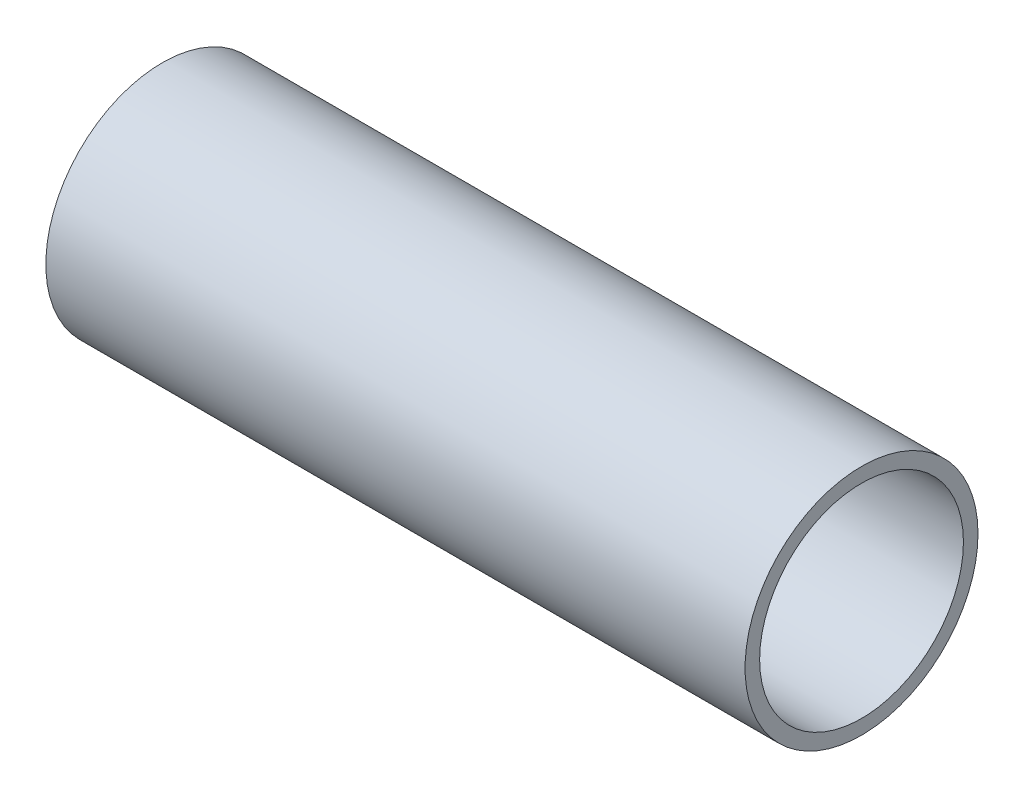
ISO-10303-21;
HEADER;
FILE_DESCRIPTION(('STEP AP214'),'2;1');
FILE_NAME('part.step','',(''),(''),'','','');
FILE_SCHEMA(('AUTOMOTIVE_DESIGN { 1 0 10303 214 1 1 1 1 }'));
ENDSEC;
DATA;
#1=APPLICATION_CONTEXT('core data for automotive mechanical design processes');
#2=APPLICATION_PROTOCOL_DEFINITION('international standard','automotive_design',2000,#1);
#3=PRODUCT_CONTEXT('',#1,'mechanical');
#4=PRODUCT('Part','Part','',(#3));
#5=PRODUCT_RELATED_PRODUCT_CATEGORY('part','',(#4));
#6=PRODUCT_DEFINITION_FORMATION('','',#4);
#7=PRODUCT_DEFINITION_CONTEXT('part definition',#1,'design');
#8=PRODUCT_DEFINITION('design','',#6,#7);
#9=PRODUCT_DEFINITION_SHAPE('','',#8);
#10=(LENGTH_UNIT() NAMED_UNIT(*) SI_UNIT(.MILLI.,.METRE.));
#11=(NAMED_UNIT(*) PLANE_ANGLE_UNIT() SI_UNIT($,.RADIAN.));
#12=(NAMED_UNIT(*) SI_UNIT($,.STERADIAN.) SOLID_ANGLE_UNIT());
#13=UNCERTAINTY_MEASURE_WITH_UNIT(LENGTH_MEASURE(1.E-05),#10,'distance_accuracy_value','');
#14=(GEOMETRIC_REPRESENTATION_CONTEXT(3) GLOBAL_UNCERTAINTY_ASSIGNED_CONTEXT((#13)) GLOBAL_UNIT_ASSIGNED_CONTEXT((#10,
#11,#12)) REPRESENTATION_CONTEXT('',''));
#15=CARTESIAN_POINT('',(0.,0.,0.));
#16=DIRECTION('',(0.,0.,1.));
#17=DIRECTION('',(1.,0.,0.));
#18=AXIS2_PLACEMENT_3D('',#15,#16,#17);
#19=CARTESIAN_POINT('',(305.,0.,0.));
#20=DIRECTION('',(1.,0.,0.));
#21=DIRECTION('',(0.,0.,-1.));
#22=AXIS2_PLACEMENT_3D('',#19,#20,#21);
#23=PLANE('',#22);
#24=CARTESIAN_POINT('',(305.,0.,0.));
#25=DIRECTION('',(1.,0.,0.));
#26=DIRECTION('',(0.,0.,-1.));
#27=AXIS2_PLACEMENT_3D('',#24,#25,#26);
#28=CIRCLE('',#27,50.8);
#29=CARTESIAN_POINT('',(305.,0.,-50.8));
#30=VERTEX_POINT('',#29);
#31=EDGE_CURVE('E10',#30,#30,#28,.T.);
#32=ORIENTED_EDGE('',*,*,#31,.T.);
#33=EDGE_LOOP('',(#32));
#34=FACE_BOUND('',#33,.T.);
#35=CARTESIAN_POINT('',(305.,0.,0.));
#36=DIRECTION('',(1.,0.,0.));
#37=DIRECTION('',(0.,0.,-1.));
#38=AXIS2_PLACEMENT_3D('',#35,#36,#37);
#39=CIRCLE('',#38,44.45);
#40=CARTESIAN_POINT('',(305.,0.,-44.45));
#41=VERTEX_POINT('',#40);
#42=EDGE_CURVE('E56',#41,#41,#39,.T.);
#43=ORIENTED_EDGE('',*,*,#42,.F.);
#44=EDGE_LOOP('',(#43));
#45=FACE_BOUND('',#44,.T.);
#46=ADVANCED_FACE('F45',(#34,#45),#23,.T.);
#47=CARTESIAN_POINT('',(0.,0.,0.));
#48=DIRECTION('',(1.,0.,0.));
#49=DIRECTION('',(0.,0.,-1.));
#50=AXIS2_PLACEMENT_3D('',#47,#48,#49);
#51=PLANE('',#50);
#52=CARTESIAN_POINT('',(0.,0.,0.));
#53=DIRECTION('',(1.,0.,0.));
#54=DIRECTION('',(0.,0.,-1.));
#55=AXIS2_PLACEMENT_3D('',#52,#53,#54);
#56=CIRCLE('',#55,50.8);
#57=CARTESIAN_POINT('',(0.,0.,-50.8));
#58=VERTEX_POINT('',#57);
#59=EDGE_CURVE('E49',#58,#58,#56,.T.);
#60=ORIENTED_EDGE('',*,*,#59,.F.);
#61=EDGE_LOOP('',(#60));
#62=FACE_BOUND('',#61,.T.);
#63=CARTESIAN_POINT('',(0.,0.,0.));
#64=DIRECTION('',(1.,0.,0.));
#65=DIRECTION('',(0.,0.,-1.));
#66=AXIS2_PLACEMENT_3D('',#63,#64,#65);
#67=CIRCLE('',#66,44.45);
#68=CARTESIAN_POINT('',(0.,0.,-44.45));
#69=VERTEX_POINT('',#68);
#70=EDGE_CURVE('E58',#69,#69,#67,.T.);
#71=ORIENTED_EDGE('',*,*,#70,.T.);
#72=EDGE_LOOP('',(#71));
#73=FACE_BOUND('',#72,.T.);
#74=ADVANCED_FACE('F68',(#62,#73),#51,.F.);
#75=CARTESIAN_POINT('',(305.,0.,0.));
#76=DIRECTION('',(-1.,0.,0.));
#77=DIRECTION('',(0.,0.,1.));
#78=AXIS2_PLACEMENT_3D('',#75,#76,#77);
#79=CYLINDRICAL_SURFACE('',#78,50.8);
#80=ORIENTED_EDGE('',*,*,#31,.F.);
#81=EDGE_LOOP('',(#80));
#82=FACE_BOUND('',#81,.T.);
#83=ORIENTED_EDGE('',*,*,#59,.T.);
#84=EDGE_LOOP('',(#83));
#85=FACE_BOUND('',#84,.T.);
#86=ADVANCED_FACE('F47',(#82,#85),#79,.T.);
#87=CARTESIAN_POINT('',(305.,0.,0.));
#88=DIRECTION('',(-1.,0.,0.));
#89=DIRECTION('',(0.,0.,1.));
#90=AXIS2_PLACEMENT_3D('',#87,#88,#89);
#91=CYLINDRICAL_SURFACE('',#90,44.45);
#92=ORIENTED_EDGE('',*,*,#42,.T.);
#93=EDGE_LOOP('',(#92));
#94=FACE_BOUND('',#93,.T.);
#95=ORIENTED_EDGE('',*,*,#70,.F.);
#96=EDGE_LOOP('',(#95));
#97=FACE_BOUND('',#96,.T.);
#98=ADVANCED_FACE('F64',(#94,#97),#91,.F.);
#99=CLOSED_SHELL('',(#46,#74,#86,#98));
#100=MANIFOLD_SOLID_BREP('B2',#99);
#101=ADVANCED_BREP_SHAPE_REPRESENTATION('',(#18,#100),#14);
#102=SHAPE_DEFINITION_REPRESENTATION(#9,#101);
ENDSEC;
END-ISO-10303-21;
